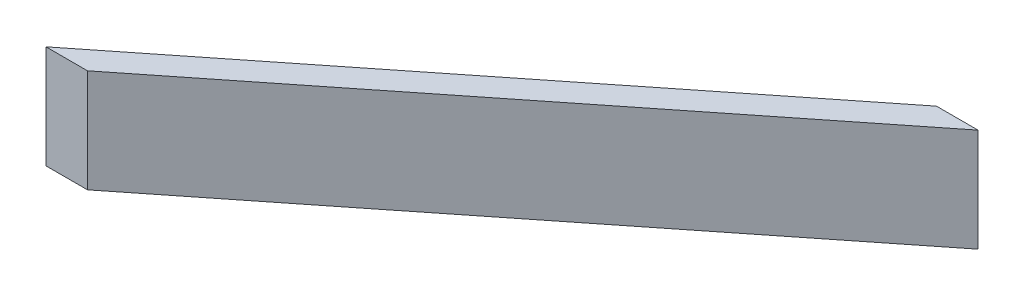
ISO-10303-21;
HEADER;
FILE_DESCRIPTION(('STEP AP214'),'2;1');
FILE_NAME('part.step','',(''),(''),'','','');
FILE_SCHEMA(('AUTOMOTIVE_DESIGN { 1 0 10303 214 1 1 1 1 }'));
ENDSEC;
DATA;
#1=APPLICATION_CONTEXT('core data for automotive mechanical design processes');
#2=APPLICATION_PROTOCOL_DEFINITION('international standard','automotive_design',2000,#1);
#3=PRODUCT_CONTEXT('',#1,'mechanical');
#4=PRODUCT('Part','Part','',(#3));
#5=PRODUCT_RELATED_PRODUCT_CATEGORY('part','',(#4));
#6=PRODUCT_DEFINITION_FORMATION('','',#4);
#7=PRODUCT_DEFINITION_CONTEXT('part definition',#1,'design');
#8=PRODUCT_DEFINITION('design','',#6,#7);
#9=PRODUCT_DEFINITION_SHAPE('','',#8);
#10=(LENGTH_UNIT() NAMED_UNIT(*) SI_UNIT(.MILLI.,.METRE.));
#11=(NAMED_UNIT(*) PLANE_ANGLE_UNIT() SI_UNIT($,.RADIAN.));
#12=(NAMED_UNIT(*) SI_UNIT($,.STERADIAN.) SOLID_ANGLE_UNIT());
#13=UNCERTAINTY_MEASURE_WITH_UNIT(LENGTH_MEASURE(1.E-05),#10,'distance_accuracy_value','');
#14=(GEOMETRIC_REPRESENTATION_CONTEXT(3) GLOBAL_UNCERTAINTY_ASSIGNED_CONTEXT((#13)) GLOBAL_UNIT_ASSIGNED_CONTEXT((#10,
#11,#12)) REPRESENTATION_CONTEXT('',''));
#15=CARTESIAN_POINT('',(0.,0.,0.));
#16=DIRECTION('',(0.,0.,1.));
#17=DIRECTION('',(1.,0.,0.));
#18=AXIS2_PLACEMENT_3D('',#15,#16,#17);
#19=CARTESIAN_POINT('',(-50.,10.,76.3959130127685));
#20=DIRECTION('',(0.,0.,-1.));
#21=DIRECTION('',(-1.,0.,0.));
#22=AXIS2_PLACEMENT_3D('',#19,#20,#21);
#23=PLANE('',#22);
#24=DIRECTION('',(1.,0.,0.));
#25=VECTOR('',#24,1.);
#26=CARTESIAN_POINT('',(-50.,-10.,76.3959130127685));
#27=LINE('',#26,#25);
#28=CARTESIAN_POINT('',(-50.,-10.,76.3959130127685));
#29=VERTEX_POINT('',#28);
#30=CARTESIAN_POINT('',(-41.9535522099588,-10.,76.3959130127685));
#31=VERTEX_POINT('',#30);
#32=EDGE_CURVE('E109',#29,#31,#27,.T.);
#33=ORIENTED_EDGE('',*,*,#32,.T.);
#34=DIRECTION('',(0.,-1.,0.));
#35=VECTOR('',#34,1.);
#36=CARTESIAN_POINT('',(-41.9535522099588,10.,76.3959130127685));
#37=LINE('',#36,#35);
#38=CARTESIAN_POINT('',(-41.9535522099588,10.,76.3959130127685));
#39=VERTEX_POINT('',#38);
#40=EDGE_CURVE('E11',#39,#31,#37,.T.);
#41=ORIENTED_EDGE('',*,*,#40,.F.);
#42=DIRECTION('',(1.,0.,0.));
#43=VECTOR('',#42,1.);
#44=CARTESIAN_POINT('',(-50.,10.,76.3959130127685));
#45=LINE('',#44,#43);
#46=CARTESIAN_POINT('',(-50.,10.,76.3959130127685));
#47=VERTEX_POINT('',#46);
#48=EDGE_CURVE('E93',#47,#39,#45,.T.);
#49=ORIENTED_EDGE('',*,*,#48,.F.);
#50=DIRECTION('',(0.,-1.,0.));
#51=VECTOR('',#50,1.);
#52=CARTESIAN_POINT('',(-50.,10.,76.3959130127685));
#53=LINE('',#52,#51);
#54=EDGE_CURVE('E105',#47,#29,#53,.T.);
#55=ORIENTED_EDGE('',*,*,#54,.T.);
#56=EDGE_LOOP('',(#33,#41,#49,#55));
#57=FACE_BOUND('',#56,.T.);
#58=ADVANCED_FACE('F41',(#57),#23,.F.);
#59=CARTESIAN_POINT('',(54.3723601842206,10.,0.));
#60=DIRECTION('',(-0.621392213118984,0.,-0.783499660162716));
#61=DIRECTION('',(-0.783499660162716,0.,0.621392213118984));
#62=AXIS2_PLACEMENT_3D('',#59,#60,#61);
#63=PLANE('',#62);
#64=DIRECTION('',(0.783499660162716,0.,-0.621392213118984));
#65=VECTOR('',#64,1.);
#66=CARTESIAN_POINT('',(54.3723601842206,-10.,0.));
#67=LINE('',#66,#65);
#68=CARTESIAN_POINT('',(54.3723601842206,-10.,0.));
#69=VERTEX_POINT('',#68);
#70=EDGE_CURVE('E98',#31,#69,#67,.T.);
#71=ORIENTED_EDGE('',*,*,#70,.T.);
#72=DIRECTION('',(0.,-1.,0.));
#73=VECTOR('',#72,1.);
#74=CARTESIAN_POINT('',(54.3723601842206,10.,0.));
#75=LINE('',#74,#73);
#76=CARTESIAN_POINT('',(54.3723601842206,10.,0.));
#77=VERTEX_POINT('',#76);
#78=EDGE_CURVE('E50',#77,#69,#75,.T.);
#79=ORIENTED_EDGE('',*,*,#78,.F.);
#80=DIRECTION('',(0.783499660162716,0.,-0.621392213118984));
#81=VECTOR('',#80,1.);
#82=CARTESIAN_POINT('',(54.3723601842206,10.,0.));
#83=LINE('',#82,#81);
#84=EDGE_CURVE('E88',#39,#77,#83,.T.);
#85=ORIENTED_EDGE('',*,*,#84,.F.);
#86=ORIENTED_EDGE('',*,*,#40,.T.);
#87=EDGE_LOOP('',(#71,#79,#85,#86));
#88=FACE_BOUND('',#87,.T.);
#89=ADVANCED_FACE('F97',(#88),#63,.F.);
#90=CARTESIAN_POINT('',(46.3259123941795,10.,0.));
#91=DIRECTION('',(0.,0.,1.));
#92=DIRECTION('',(1.,0.,0.));
#93=AXIS2_PLACEMENT_3D('',#90,#91,#92);
#94=PLANE('',#93);
#95=DIRECTION('',(-1.,0.,0.));
#96=VECTOR('',#95,1.);
#97=CARTESIAN_POINT('',(46.3259123941795,-10.,0.));
#98=LINE('',#97,#96);
#99=CARTESIAN_POINT('',(46.3259123941795,-10.,0.));
#100=VERTEX_POINT('',#99);
#101=EDGE_CURVE('E75',#69,#100,#98,.T.);
#102=ORIENTED_EDGE('',*,*,#101,.T.);
#103=DIRECTION('',(0.,-1.,0.));
#104=VECTOR('',#103,1.);
#105=CARTESIAN_POINT('',(46.3259123941795,10.,0.));
#106=LINE('',#105,#104);
#107=CARTESIAN_POINT('',(46.3259123941795,10.,0.));
#108=VERTEX_POINT('',#107);
#109=EDGE_CURVE('E100',#108,#100,#106,.T.);
#110=ORIENTED_EDGE('',*,*,#109,.F.);
#111=DIRECTION('',(-1.,0.,0.));
#112=VECTOR('',#111,1.);
#113=CARTESIAN_POINT('',(46.3259123941795,10.,0.));
#114=LINE('',#113,#112);
#115=EDGE_CURVE('E91',#77,#108,#114,.T.);
#116=ORIENTED_EDGE('',*,*,#115,.F.);
#117=ORIENTED_EDGE('',*,*,#78,.T.);
#118=EDGE_LOOP('',(#102,#110,#116,#117));
#119=FACE_BOUND('',#118,.T.);
#120=ADVANCED_FACE('F101',(#119),#94,.F.);
#121=CARTESIAN_POINT('',(-50.,10.,76.3959130127685));
#122=DIRECTION('',(0.621392213118984,0.,0.783499660162716));
#123=DIRECTION('',(0.783499660162716,0.,-0.621392213118984));
#124=AXIS2_PLACEMENT_3D('',#121,#122,#123);
#125=PLANE('',#124);
#126=DIRECTION('',(-0.783499660162716,0.,0.621392213118984));
#127=VECTOR('',#126,1.);
#128=CARTESIAN_POINT('',(-50.,-10.,76.3959130127685));
#129=LINE('',#128,#127);
#130=EDGE_CURVE('E81',#100,#29,#129,.T.);
#131=ORIENTED_EDGE('',*,*,#130,.T.);
#132=ORIENTED_EDGE('',*,*,#54,.F.);
#133=DIRECTION('',(-0.783499660162716,0.,0.621392213118984));
#134=VECTOR('',#133,1.);
#135=CARTESIAN_POINT('',(-50.,10.,76.3959130127685));
#136=LINE('',#135,#134);
#137=EDGE_CURVE('E58',#108,#47,#136,.T.);
#138=ORIENTED_EDGE('',*,*,#137,.F.);
#139=ORIENTED_EDGE('',*,*,#109,.T.);
#140=EDGE_LOOP('',(#131,#132,#138,#139));
#141=FACE_BOUND('',#140,.T.);
#142=ADVANCED_FACE('F122',(#141),#125,.F.);
#143=CARTESIAN_POINT('',(0.,10.,0.));
#144=DIRECTION('',(0.,-1.,0.));
#145=DIRECTION('',(0.,0.,-1.));
#146=AXIS2_PLACEMENT_3D('',#143,#144,#145);
#147=PLANE('',#146);
#148=ORIENTED_EDGE('',*,*,#48,.T.);
#149=ORIENTED_EDGE('',*,*,#84,.T.);
#150=ORIENTED_EDGE('',*,*,#115,.T.);
#151=ORIENTED_EDGE('',*,*,#137,.T.);
#152=EDGE_LOOP('',(#148,#149,#150,#151));
#153=FACE_BOUND('',#152,.T.);
#154=ADVANCED_FACE('F89',(#153),#147,.F.);
#155=CARTESIAN_POINT('',(0.,-10.,0.));
#156=DIRECTION('',(0.,-1.,0.));
#157=DIRECTION('',(0.,0.,-1.));
#158=AXIS2_PLACEMENT_3D('',#155,#156,#157);
#159=PLANE('',#158);
#160=ORIENTED_EDGE('',*,*,#32,.F.);
#161=ORIENTED_EDGE('',*,*,#130,.F.);
#162=ORIENTED_EDGE('',*,*,#101,.F.);
#163=ORIENTED_EDGE('',*,*,#70,.F.);
#164=EDGE_LOOP('',(#160,#161,#162,#163));
#165=FACE_BOUND('',#164,.T.);
#166=ADVANCED_FACE('F125',(#165),#159,.T.);
#167=CLOSED_SHELL('',(#58,#89,#120,#142,#154,#166));
#168=MANIFOLD_SOLID_BREP('B2',#167);
#169=ADVANCED_BREP_SHAPE_REPRESENTATION('',(#18,#168),#14);
#170=SHAPE_DEFINITION_REPRESENTATION(#9,#169);
ENDSEC;
END-ISO-10303-21;
